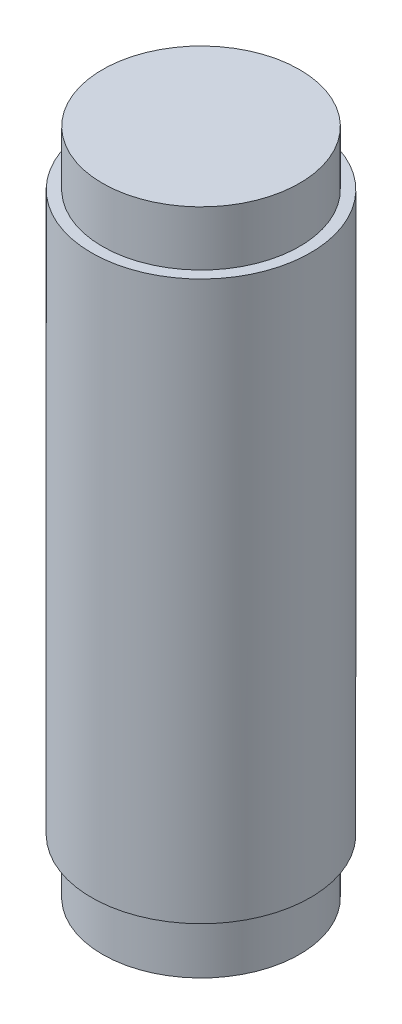
ISO-10303-21;
HEADER;
FILE_DESCRIPTION(('STEP AP214'),'2;1');
FILE_NAME('part.step','',(''),(''),'','','');
FILE_SCHEMA(('AUTOMOTIVE_DESIGN { 1 0 10303 214 1 1 1 1 }'));
ENDSEC;
DATA;
#1=APPLICATION_CONTEXT('core data for automotive mechanical design processes');
#2=APPLICATION_PROTOCOL_DEFINITION('international standard','automotive_design',2000,#1);
#3=PRODUCT_CONTEXT('',#1,'mechanical');
#4=PRODUCT('Part','Part','',(#3));
#5=PRODUCT_RELATED_PRODUCT_CATEGORY('part','',(#4));
#6=PRODUCT_DEFINITION_FORMATION('','',#4);
#7=PRODUCT_DEFINITION_CONTEXT('part definition',#1,'design');
#8=PRODUCT_DEFINITION('design','',#6,#7);
#9=PRODUCT_DEFINITION_SHAPE('','',#8);
#10=(LENGTH_UNIT() NAMED_UNIT(*) SI_UNIT(.MILLI.,.METRE.));
#11=(NAMED_UNIT(*) PLANE_ANGLE_UNIT() SI_UNIT($,.RADIAN.));
#12=(NAMED_UNIT(*) SI_UNIT($,.STERADIAN.) SOLID_ANGLE_UNIT());
#13=UNCERTAINTY_MEASURE_WITH_UNIT(LENGTH_MEASURE(1.E-05),#10,'distance_accuracy_value','');
#14=(GEOMETRIC_REPRESENTATION_CONTEXT(3) GLOBAL_UNCERTAINTY_ASSIGNED_CONTEXT((#13)) GLOBAL_UNIT_ASSIGNED_CONTEXT((#10,
#11,#12)) REPRESENTATION_CONTEXT('',''));
#15=CARTESIAN_POINT('',(0.,0.,0.));
#16=DIRECTION('',(0.,0.,1.));
#17=DIRECTION('',(1.,0.,0.));
#18=AXIS2_PLACEMENT_3D('',#15,#16,#17);
#19=CARTESIAN_POINT('',(0.,30.5,0.));
#20=DIRECTION('',(0.,-1.,0.));
#21=DIRECTION('',(0.,0.,-1.));
#22=AXIS2_PLACEMENT_3D('',#19,#20,#21);
#23=CYLINDRICAL_SURFACE('',#22,5.);
#24=CARTESIAN_POINT('',(0.,2.5,0.));
#25=DIRECTION('',(0.,-1.,0.));
#26=DIRECTION('',(0.,0.,-1.));
#27=AXIS2_PLACEMENT_3D('',#24,#25,#26);
#28=CIRCLE('',#27,5.);
#29=CARTESIAN_POINT('',(0.,2.5,-5.));
#30=VERTEX_POINT('',#29);
#31=EDGE_CURVE('E10',#30,#30,#28,.T.);
#32=ORIENTED_EDGE('',*,*,#31,.F.);
#33=EDGE_LOOP('',(#32));
#34=FACE_BOUND('',#33,.T.);
#35=CARTESIAN_POINT('',(0.,28.,0.));
#36=DIRECTION('',(0.,1.,0.));
#37=DIRECTION('',(0.,0.,1.));
#38=AXIS2_PLACEMENT_3D('',#35,#36,#37);
#39=CIRCLE('',#38,5.);
#40=CARTESIAN_POINT('',(0.,28.,5.));
#41=VERTEX_POINT('',#40);
#42=EDGE_CURVE('E46',#41,#41,#39,.T.);
#43=ORIENTED_EDGE('',*,*,#42,.F.);
#44=EDGE_LOOP('',(#43));
#45=FACE_BOUND('',#44,.T.);
#46=ADVANCED_FACE('F31',(#34,#45),#23,.T.);
#47=CARTESIAN_POINT('',(0.,2.5,0.));
#48=DIRECTION('',(0.,-1.,0.));
#49=DIRECTION('',(0.,0.,-1.));
#50=AXIS2_PLACEMENT_3D('',#47,#48,#49);
#51=PLANE('',#50);
#52=CARTESIAN_POINT('',(0.,2.5,0.));
#53=DIRECTION('',(0.,-1.,0.));
#54=DIRECTION('',(0.,0.,-1.));
#55=AXIS2_PLACEMENT_3D('',#52,#53,#54);
#56=CIRCLE('',#55,4.5);
#57=CARTESIAN_POINT('',(0.,2.5,-4.5));
#58=VERTEX_POINT('',#57);
#59=EDGE_CURVE('E37',#58,#58,#56,.T.);
#60=ORIENTED_EDGE('',*,*,#59,.F.);
#61=EDGE_LOOP('',(#60));
#62=FACE_BOUND('',#61,.T.);
#63=ORIENTED_EDGE('',*,*,#31,.T.);
#64=EDGE_LOOP('',(#63));
#65=FACE_BOUND('',#64,.T.);
#66=ADVANCED_FACE('F68',(#62,#65),#51,.T.);
#67=CARTESIAN_POINT('',(0.,2.5,0.));
#68=DIRECTION('',(0.,-1.,0.));
#69=DIRECTION('',(0.,0.,-1.));
#70=AXIS2_PLACEMENT_3D('',#67,#68,#69);
#71=CYLINDRICAL_SURFACE('',#70,4.5);
#72=ORIENTED_EDGE('',*,*,#59,.T.);
#73=EDGE_LOOP('',(#72));
#74=FACE_BOUND('',#73,.T.);
#75=CARTESIAN_POINT('',(0.,0.,0.));
#76=DIRECTION('',(0.,-1.,0.));
#77=DIRECTION('',(0.,0.,-1.));
#78=AXIS2_PLACEMENT_3D('',#75,#76,#77);
#79=CIRCLE('',#78,4.5);
#80=CARTESIAN_POINT('',(0.,0.,-4.5));
#81=VERTEX_POINT('',#80);
#82=EDGE_CURVE('E41',#81,#81,#79,.T.);
#83=ORIENTED_EDGE('',*,*,#82,.F.);
#84=EDGE_LOOP('',(#83));
#85=FACE_BOUND('',#84,.T.);
#86=ADVANCED_FACE('F73',(#74,#85),#71,.T.);
#87=CARTESIAN_POINT('',(0.,0.,0.));
#88=DIRECTION('',(0.,1.,0.));
#89=DIRECTION('',(0.,0.,1.));
#90=AXIS2_PLACEMENT_3D('',#87,#88,#89);
#91=PLANE('',#90);
#92=ORIENTED_EDGE('',*,*,#82,.T.);
#93=EDGE_LOOP('',(#92));
#94=FACE_BOUND('',#93,.T.);
#95=ADVANCED_FACE('F63',(#94),#91,.F.);
#96=CARTESIAN_POINT('',(0.,28.,0.));
#97=DIRECTION('',(0.,1.,0.));
#98=DIRECTION('',(0.,0.,1.));
#99=AXIS2_PLACEMENT_3D('',#96,#97,#98);
#100=PLANE('',#99);
#101=CARTESIAN_POINT('',(0.,28.,0.));
#102=DIRECTION('',(0.,1.,0.));
#103=DIRECTION('',(0.,0.,1.));
#104=AXIS2_PLACEMENT_3D('',#101,#102,#103);
#105=CIRCLE('',#104,4.5);
#106=CARTESIAN_POINT('',(0.,28.,4.5));
#107=VERTEX_POINT('',#106);
#108=EDGE_CURVE('E50',#107,#107,#105,.T.);
#109=ORIENTED_EDGE('',*,*,#108,.F.);
#110=EDGE_LOOP('',(#109));
#111=FACE_BOUND('',#110,.T.);
#112=ORIENTED_EDGE('',*,*,#42,.T.);
#113=EDGE_LOOP('',(#112));
#114=FACE_BOUND('',#113,.T.);
#115=ADVANCED_FACE('F60',(#111,#114),#100,.T.);
#116=CARTESIAN_POINT('',(0.,28.,0.));
#117=DIRECTION('',(0.,1.,0.));
#118=DIRECTION('',(0.,0.,1.));
#119=AXIS2_PLACEMENT_3D('',#116,#117,#118);
#120=CYLINDRICAL_SURFACE('',#119,4.5);
#121=ORIENTED_EDGE('',*,*,#108,.T.);
#122=EDGE_LOOP('',(#121));
#123=FACE_BOUND('',#122,.T.);
#124=CARTESIAN_POINT('',(0.,30.5,0.));
#125=DIRECTION('',(0.,1.,0.));
#126=DIRECTION('',(0.,0.,1.));
#127=AXIS2_PLACEMENT_3D('',#124,#125,#126);
#128=CIRCLE('',#127,4.5);
#129=CARTESIAN_POINT('',(0.,30.5,4.5));
#130=VERTEX_POINT('',#129);
#131=EDGE_CURVE('E51',#130,#130,#128,.T.);
#132=ORIENTED_EDGE('',*,*,#131,.F.);
#133=EDGE_LOOP('',(#132));
#134=FACE_BOUND('',#133,.T.);
#135=ADVANCED_FACE('F57',(#123,#134),#120,.T.);
#136=CARTESIAN_POINT('',(0.,30.5,0.));
#137=DIRECTION('',(0.,1.,0.));
#138=DIRECTION('',(0.,0.,1.));
#139=AXIS2_PLACEMENT_3D('',#136,#137,#138);
#140=PLANE('',#139);
#141=ORIENTED_EDGE('',*,*,#131,.T.);
#142=EDGE_LOOP('',(#141));
#143=FACE_BOUND('',#142,.T.);
#144=ADVANCED_FACE('F81',(#143),#140,.T.);
#145=CLOSED_SHELL('',(#46,#66,#86,#95,#115,#135,#144));
#146=MANIFOLD_SOLID_BREP('B2',#145);
#147=ADVANCED_BREP_SHAPE_REPRESENTATION('',(#18,#146),#14);
#148=SHAPE_DEFINITION_REPRESENTATION(#9,#147);
ENDSEC;
END-ISO-10303-21;
